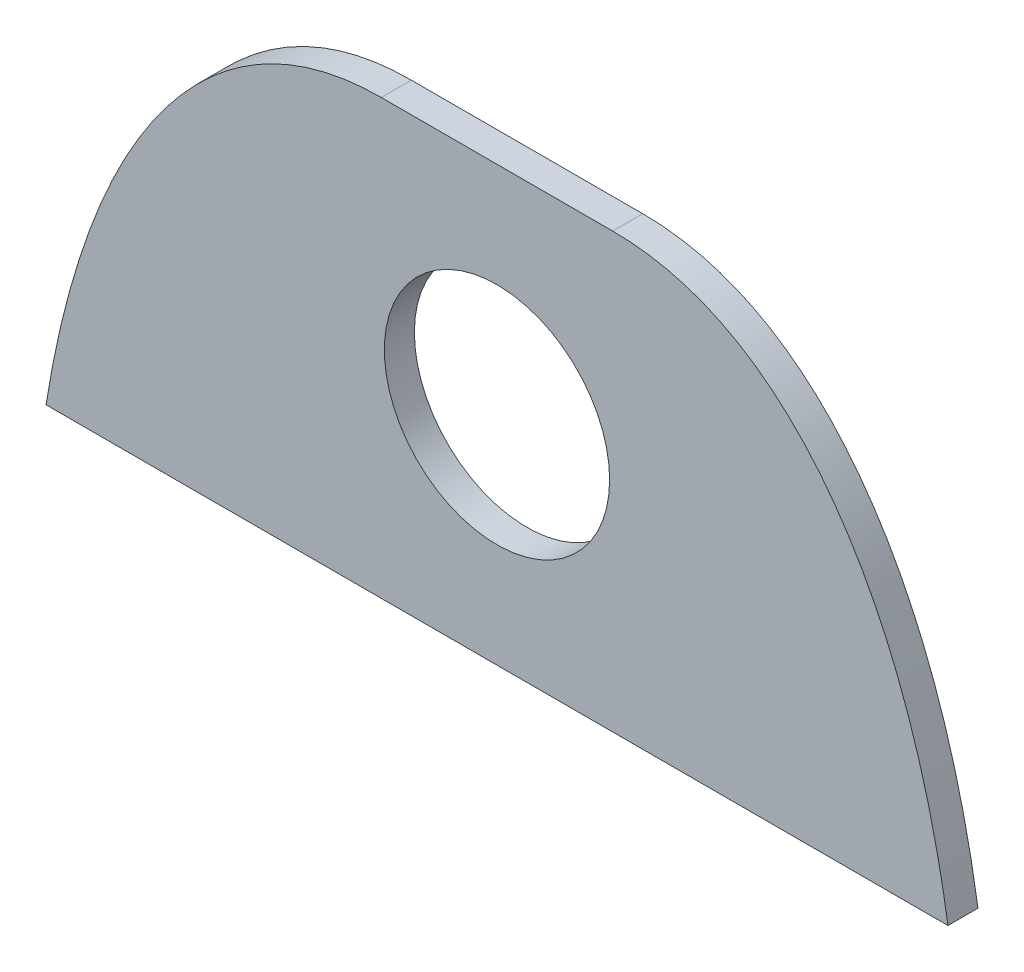
ISO-10303-21;
HEADER;
FILE_DESCRIPTION(('STEP AP214'),'2;1');
FILE_NAME('part.step','',(''),(''),'','','');
FILE_SCHEMA(('AUTOMOTIVE_DESIGN { 1 0 10303 214 1 1 1 1 }'));
ENDSEC;
DATA;
#1=APPLICATION_CONTEXT('core data for automotive mechanical design processes');
#2=APPLICATION_PROTOCOL_DEFINITION('international standard','automotive_design',2000,#1);
#3=PRODUCT_CONTEXT('',#1,'mechanical');
#4=PRODUCT('Part','Part','',(#3));
#5=PRODUCT_RELATED_PRODUCT_CATEGORY('part','',(#4));
#6=PRODUCT_DEFINITION_FORMATION('','',#4);
#7=PRODUCT_DEFINITION_CONTEXT('part definition',#1,'design');
#8=PRODUCT_DEFINITION('design','',#6,#7);
#9=PRODUCT_DEFINITION_SHAPE('','',#8);
#10=(LENGTH_UNIT() NAMED_UNIT(*) SI_UNIT(.MILLI.,.METRE.));
#11=(NAMED_UNIT(*) PLANE_ANGLE_UNIT() SI_UNIT($,.RADIAN.));
#12=(NAMED_UNIT(*) SI_UNIT($,.STERADIAN.) SOLID_ANGLE_UNIT());
#13=UNCERTAINTY_MEASURE_WITH_UNIT(LENGTH_MEASURE(1.E-05),#10,'distance_accuracy_value','');
#14=(GEOMETRIC_REPRESENTATION_CONTEXT(3) GLOBAL_UNCERTAINTY_ASSIGNED_CONTEXT((#13)) GLOBAL_UNIT_ASSIGNED_CONTEXT((#10,
#11,#12)) REPRESENTATION_CONTEXT('',''));
#15=CARTESIAN_POINT('',(0.,0.,0.));
#16=DIRECTION('',(0.,0.,1.));
#17=DIRECTION('',(1.,0.,0.));
#18=AXIS2_PLACEMENT_3D('',#15,#16,#17);
#19=CARTESIAN_POINT('',(5.66946098612702,7.33530402938872,0.508));
#20=CARTESIAN_POINT('',(5.24399608609414,7.33530402938872,0.508));
#21=CARTESIAN_POINT('',(4.82870261388946,7.27466993287705,0.508));
#22=CARTESIAN_POINT('',(4.22236554574973,7.08474385358666,0.508));
#23=CARTESIAN_POINT('',(4.02461723723038,7.00508067398969,0.508));
#24=CARTESIAN_POINT('',(3.64748565891863,6.81918342127818,0.508));
#25=CARTESIAN_POINT('',(3.46649138673624,6.71248359802857,0.508));
#26=CARTESIAN_POINT('',(3.11843433597096,6.47378192656136,0.508));
#27=CARTESIAN_POINT('',(2.95096324808215,6.34117499174921,0.508));
#28=CARTESIAN_POINT('',(2.63715643816514,6.06047445688974,0.508));
#29=CARTESIAN_POINT('',(2.48955789656992,5.91162915855113,0.508));
#30=CARTESIAN_POINT('',(2.07054123556324,5.44338386014078,0.508));
#31=CARTESIAN_POINT('',(1.82099770892891,5.09952827246685,0.508));
#32=CARTESIAN_POINT('',(1.15988363679891,4.02348098614177,0.508));
#33=CARTESIAN_POINT('',(0.833207908036054,3.25461560426947,0.508));
#34=CARTESIAN_POINT('',(0.445697358196499,2.05503805428413,0.508));
#35=CARTESIAN_POINT('',(0.334748925713697,1.64770618611744,0.508));
#36=CARTESIAN_POINT('',(0.144996604274143,0.828712341510663,0.508));
#37=CARTESIAN_POINT('',(0.0658201697768552,0.415806296298574,0.508));
#38=CARTESIAN_POINT('',(0.,0.,0.508));
#39=B_SPLINE_CURVE_WITH_KNOTS('',3,(#19,#20,#21,#22,#23,#24,#25,#26,#27,#28,#29,#30,#31,#32,#33,
#34,#35,#36,#37,#38),.UNSPECIFIED.,.F.,.F.,(4,2,2,2,2,2,2,2,2,4),(0.,0.125000000000001,
0.187500000000001,0.25,0.3125,0.375,0.499999999999999,0.749999999999999,0.875,1.),.UNSPECIFIED.);
#40=DIRECTION('',(0.,0.,-1.));
#41=VECTOR('',#40,1.);
#42=SURFACE_OF_LINEAR_EXTRUSION('',#39,#41);
#43=CARTESIAN_POINT('',(5.66946098612702,7.33530402938872,0.));
#44=CARTESIAN_POINT('',(5.24399608609414,7.33530402938872,0.));
#45=CARTESIAN_POINT('',(4.82870261388946,7.27466993287705,0.));
#46=CARTESIAN_POINT('',(4.22236554574973,7.08474385358666,0.));
#47=CARTESIAN_POINT('',(4.02461723723038,7.00508067398969,0.));
#48=CARTESIAN_POINT('',(3.64748565891863,6.81918342127818,0.));
#49=CARTESIAN_POINT('',(3.46649138673624,6.71248359802857,0.));
#50=CARTESIAN_POINT('',(3.11843433597096,6.47378192656136,0.));
#51=CARTESIAN_POINT('',(2.95096324808215,6.34117499174921,0.));
#52=CARTESIAN_POINT('',(2.63715643816514,6.06047445688974,0.));
#53=CARTESIAN_POINT('',(2.48955789656992,5.91162915855113,0.));
#54=CARTESIAN_POINT('',(2.07054123556324,5.44338386014078,0.));
#55=CARTESIAN_POINT('',(1.82099770892891,5.09952827246685,0.));
#56=CARTESIAN_POINT('',(1.15988363679891,4.02348098614177,0.));
#57=CARTESIAN_POINT('',(0.833207908036054,3.25461560426947,0.));
#58=CARTESIAN_POINT('',(0.445697358196499,2.05503805428413,0.));
#59=CARTESIAN_POINT('',(0.334748925713697,1.64770618611744,0.));
#60=CARTESIAN_POINT('',(0.144996604274143,0.828712341510663,0.));
#61=CARTESIAN_POINT('',(0.0658201697768552,0.415806296298574,0.));
#62=CARTESIAN_POINT('',(0.,0.,0.));
#63=B_SPLINE_CURVE_WITH_KNOTS('',3,(#43,#44,#45,#46,#47,#48,#49,#50,#51,#52,#53,#54,#55,#56,#57,
#58,#59,#60,#61,#62),.UNSPECIFIED.,.F.,.F.,(4,2,2,2,2,2,2,2,2,4),(0.,0.125000000000001,
0.187500000000001,0.25,0.3125,0.375,0.499999999999999,0.749999999999999,0.875,1.),.UNSPECIFIED.);
#64=CARTESIAN_POINT('',(5.66946098612702,7.33530402938872,0.));
#65=VERTEX_POINT('',#64);
#66=CARTESIAN_POINT('',(0.,0.,0.));
#67=VERTEX_POINT('',#66);
#68=EDGE_CURVE('E136',#65,#67,#63,.T.);
#69=ORIENTED_EDGE('',*,*,#68,.T.);
#70=DIRECTION('',(0.,0.,-1.));
#71=VECTOR('',#70,1.);
#72=CARTESIAN_POINT('',(0.,0.,0.508));
#73=LINE('',#72,#71);
#74=CARTESIAN_POINT('',(0.,0.,0.508));
#75=VERTEX_POINT('',#74);
#76=EDGE_CURVE('E11',#75,#67,#73,.T.);
#77=ORIENTED_EDGE('',*,*,#76,.F.);
#78=CARTESIAN_POINT('',(0.,0.,0.508));
#79=CARTESIAN_POINT('',(0.0658201697768552,0.415806296298574,0.508));
#80=CARTESIAN_POINT('',(0.144996604274143,0.828712341510663,0.508));
#81=CARTESIAN_POINT('',(0.334748925713697,1.64770618611744,0.508));
#82=CARTESIAN_POINT('',(0.445697358196499,2.05503805428413,0.508));
#83=CARTESIAN_POINT('',(0.833207908036054,3.25461560426947,0.508));
#84=CARTESIAN_POINT('',(1.15988363679891,4.02348098614177,0.508));
#85=CARTESIAN_POINT('',(1.82099770892891,5.09952827246685,0.508));
#86=CARTESIAN_POINT('',(2.07054123556324,5.44338386014078,0.508));
#87=CARTESIAN_POINT('',(2.48955789656992,5.91162915855113,0.508));
#88=CARTESIAN_POINT('',(2.63715643816514,6.06047445688974,0.508));
#89=CARTESIAN_POINT('',(2.95096324808215,6.34117499174921,0.508));
#90=CARTESIAN_POINT('',(3.11843433597096,6.47378192656136,0.508));
#91=CARTESIAN_POINT('',(3.46649138673624,6.71248359802857,0.508));
#92=CARTESIAN_POINT('',(3.64748565891863,6.81918342127818,0.508));
#93=CARTESIAN_POINT('',(4.02461723723038,7.00508067398969,0.508));
#94=CARTESIAN_POINT('',(4.22236554574973,7.08474385358666,0.508));
#95=CARTESIAN_POINT('',(4.82870261388946,7.27466993287705,0.508));
#96=CARTESIAN_POINT('',(5.24399608609414,7.33530402938872,0.508));
#97=CARTESIAN_POINT('',(5.66946098612702,7.33530402938872,0.508));
#98=B_SPLINE_CURVE_WITH_KNOTS('',3,(#78,#79,#80,#81,#82,#83,#84,#85,#86,#87,#88,#89,#90,#91,#92,
#93,#94,#95,#96,#97),.UNSPECIFIED.,.F.,.F.,(4,2,2,2,2,2,2,2,2,4),(0.,0.125,0.250000000000001,
0.500000000000001,0.625,0.6875,0.75,0.812499999999999,0.874999999999999,1.),.UNSPECIFIED.);
#99=CARTESIAN_POINT('',(5.66946098612702,7.33530402938872,0.508));
#100=VERTEX_POINT('',#99);
#101=EDGE_CURVE('E87',#100,#75,#98,.F.);
#102=ORIENTED_EDGE('',*,*,#101,.F.);
#103=DIRECTION('',(0.,0.,-1.));
#104=VECTOR('',#103,1.);
#105=CARTESIAN_POINT('',(5.66946098612702,7.33530402938872,0.508));
#106=LINE('',#105,#104);
#107=EDGE_CURVE('E196',#100,#65,#106,.T.);
#108=ORIENTED_EDGE('',*,*,#107,.T.);
#109=EDGE_LOOP('',(#69,#77,#102,#108));
#110=FACE_BOUND('',#109,.T.);
#111=ADVANCED_FACE('F30',(#110),#42,.F.);
#112=CARTESIAN_POINT('',(0.,0.,0.508));
#113=DIRECTION('',(0.,1.,0.));
#114=DIRECTION('',(0.,0.,1.));
#115=AXIS2_PLACEMENT_3D('',#112,#113,#114);
#116=PLANE('',#115);
#117=DIRECTION('',(1.,0.,0.));
#118=VECTOR('',#117,1.);
#119=CARTESIAN_POINT('',(0.,0.,0.));
#120=LINE('',#119,#118);
#121=CARTESIAN_POINT('',(15.2521996818164,0.,0.));
#122=VERTEX_POINT('',#121);
#123=EDGE_CURVE('E92',#67,#122,#120,.T.);
#124=ORIENTED_EDGE('',*,*,#123,.T.);
#125=DIRECTION('',(0.,0.,-1.));
#126=VECTOR('',#125,1.);
#127=CARTESIAN_POINT('',(15.2521996818164,0.,0.508));
#128=LINE('',#127,#126);
#129=CARTESIAN_POINT('',(15.2521996818164,0.,0.508));
#130=VERTEX_POINT('',#129);
#131=EDGE_CURVE('E41',#130,#122,#128,.T.);
#132=ORIENTED_EDGE('',*,*,#131,.F.);
#133=DIRECTION('',(1.,0.,0.));
#134=VECTOR('',#133,1.);
#135=CARTESIAN_POINT('',(0.,0.,0.508));
#136=LINE('',#135,#134);
#137=EDGE_CURVE('E81',#75,#130,#136,.T.);
#138=ORIENTED_EDGE('',*,*,#137,.F.);
#139=ORIENTED_EDGE('',*,*,#76,.T.);
#140=EDGE_LOOP('',(#124,#132,#138,#139));
#141=FACE_BOUND('',#140,.T.);
#142=ADVANCED_FACE('F91',(#141),#116,.F.);
#143=CARTESIAN_POINT('',(15.2521996818164,0.,0.508));
#144=CARTESIAN_POINT('',(15.1207046971776,0.830694340807583,0.508));
#145=CARTESIAN_POINT('',(14.9374978464808,1.64694484502402,0.508));
#146=CARTESIAN_POINT('',(14.5531063460122,2.84071305573713,0.508));
#147=CARTESIAN_POINT('',(14.4065113355869,3.23347840054969,0.508));
#148=CARTESIAN_POINT('',(14.0653978287484,4.00562340032727,0.508));
#149=CARTESIAN_POINT('',(13.8724360191829,4.38122054781542,0.508));
#150=CARTESIAN_POINT('',(13.4322374370997,5.09798558954534,0.508));
#151=CARTESIAN_POINT('',(13.1819829390798,5.44302710468932,0.508));
#152=CARTESIAN_POINT('',(12.6225692419024,6.06815241853398,0.508));
#153=CARTESIAN_POINT('',(12.3136272308752,6.34968751628862,0.508));
#154=CARTESIAN_POINT('',(11.7910410416017,6.7091891053938,0.508));
#155=CARTESIAN_POINT('',(11.6074269086612,6.81766862937541,0.508));
#156=CARTESIAN_POINT('',(11.230562195319,7.00378676662493,0.508));
#157=CARTESIAN_POINT('',(11.0359754824785,7.08240154661814,0.508));
#158=CARTESIAN_POINT('',(10.6338317079852,7.20918966695784,0.508));
#159=CARTESIAN_POINT('',(10.4251743864047,7.2573120185264,0.508));
#160=CARTESIAN_POINT('',(10.0066795562789,7.32008262209734,0.508));
#161=CARTESIAN_POINT('',(9.79558081524825,7.33530402939743,0.508));
#162=CARTESIAN_POINT('',(9.58273869568794,7.33530402939743,0.508));
#163=B_SPLINE_CURVE_WITH_KNOTS('',3,(#143,#144,#145,#146,#147,#148,#149,#150,#151,#152,#153,
#154,#155,#156,#157,#158,#159,#160,#161,#162),.UNSPECIFIED.,.F.,.F.,(4,2,2,2,2,2,2,2,2,4),(0.,
0.250000000000003,0.375000000000002,0.500000000000002,0.625000000000001,0.75,0.8125,0.875,
0.9375,1.),.UNSPECIFIED.);
#164=DIRECTION('',(0.,0.,-1.));
#165=VECTOR('',#164,1.);
#166=SURFACE_OF_LINEAR_EXTRUSION('',#163,#165);
#167=CARTESIAN_POINT('',(15.2521996818164,0.,0.));
#168=CARTESIAN_POINT('',(15.1207046971776,0.830694340807583,0.));
#169=CARTESIAN_POINT('',(14.9374978464808,1.64694484502402,0.));
#170=CARTESIAN_POINT('',(14.5531063460122,2.84071305573713,0.));
#171=CARTESIAN_POINT('',(14.4065113355869,3.23347840054969,0.));
#172=CARTESIAN_POINT('',(14.0653978287484,4.00562340032727,0.));
#173=CARTESIAN_POINT('',(13.8724360191829,4.38122054781542,0.));
#174=CARTESIAN_POINT('',(13.4322374370997,5.09798558954534,0.));
#175=CARTESIAN_POINT('',(13.1819829390798,5.44302710468932,0.));
#176=CARTESIAN_POINT('',(12.6225692419024,6.06815241853398,0.));
#177=CARTESIAN_POINT('',(12.3136272308752,6.34968751628862,0.));
#178=CARTESIAN_POINT('',(11.7910410416017,6.7091891053938,0.));
#179=CARTESIAN_POINT('',(11.6074269086612,6.81766862937541,0.));
#180=CARTESIAN_POINT('',(11.230562195319,7.00378676662493,0.));
#181=CARTESIAN_POINT('',(11.0359754824785,7.08240154661814,0.));
#182=CARTESIAN_POINT('',(10.6338317079852,7.20918966695784,0.));
#183=CARTESIAN_POINT('',(10.4251743864047,7.2573120185264,0.));
#184=CARTESIAN_POINT('',(10.0066795562789,7.32008262209734,0.));
#185=CARTESIAN_POINT('',(9.79558081524825,7.33530402939743,0.));
#186=CARTESIAN_POINT('',(9.58273869568794,7.33530402939743,0.));
#187=B_SPLINE_CURVE_WITH_KNOTS('',3,(#167,#168,#169,#170,#171,#172,#173,#174,#175,#176,#177,
#178,#179,#180,#181,#182,#183,#184,#185,#186),.UNSPECIFIED.,.F.,.F.,(4,2,2,2,2,2,2,2,2,4),(0.,
0.250000000000003,0.375000000000002,0.500000000000002,0.625000000000001,0.75,0.8125,0.875,
0.9375,1.),.UNSPECIFIED.);
#188=CARTESIAN_POINT('',(9.58273869568794,7.33530402939743,0.));
#189=VERTEX_POINT('',#188);
#190=EDGE_CURVE('E67',#122,#189,#187,.T.);
#191=ORIENTED_EDGE('',*,*,#190,.T.);
#192=DIRECTION('',(0.,0.,-1.));
#193=VECTOR('',#192,1.);
#194=CARTESIAN_POINT('',(9.58273869568794,7.33530402939743,0.508));
#195=LINE('',#194,#193);
#196=CARTESIAN_POINT('',(9.58273869568794,7.33530402939743,0.508));
#197=VERTEX_POINT('',#196);
#198=EDGE_CURVE('E93',#197,#189,#195,.T.);
#199=ORIENTED_EDGE('',*,*,#198,.F.);
#200=CARTESIAN_POINT('',(9.58273869568794,7.33530402939743,0.508));
#201=CARTESIAN_POINT('',(9.79558081524825,7.33530402939743,0.508));
#202=CARTESIAN_POINT('',(10.0066795562789,7.32008262209734,0.508));
#203=CARTESIAN_POINT('',(10.4251743864047,7.2573120185264,0.508));
#204=CARTESIAN_POINT('',(10.6338317079852,7.20918966695784,0.508));
#205=CARTESIAN_POINT('',(11.0359754824785,7.08240154661814,0.508));
#206=CARTESIAN_POINT('',(11.230562195319,7.00378676662493,0.508));
#207=CARTESIAN_POINT('',(11.6074269086612,6.81766862937541,0.508));
#208=CARTESIAN_POINT('',(11.7910410416017,6.7091891053938,0.508));
#209=CARTESIAN_POINT('',(12.3136272308752,6.34968751628862,0.508));
#210=CARTESIAN_POINT('',(12.6225692419024,6.06815241853398,0.508));
#211=CARTESIAN_POINT('',(13.1819829390798,5.44302710468932,0.508));
#212=CARTESIAN_POINT('',(13.4322374370997,5.09798558954534,0.508));
#213=CARTESIAN_POINT('',(13.8724360191829,4.38122054781542,0.508));
#214=CARTESIAN_POINT('',(14.0653978287484,4.00562340032727,0.508));
#215=CARTESIAN_POINT('',(14.4065113355869,3.23347840054969,0.508));
#216=CARTESIAN_POINT('',(14.5531063460122,2.84071305573713,0.508));
#217=CARTESIAN_POINT('',(14.9374978464808,1.64694484502402,0.508));
#218=CARTESIAN_POINT('',(15.1207046971776,0.830694340807583,0.508));
#219=CARTESIAN_POINT('',(15.2521996818164,0.,0.508));
#220=B_SPLINE_CURVE_WITH_KNOTS('',3,(#200,#201,#202,#203,#204,#205,#206,#207,#208,#209,#210,
#211,#212,#213,#214,#215,#216,#217,#218,#219),.UNSPECIFIED.,.F.,.F.,(4,2,2,2,2,2,2,2,2,4),(0.,
0.0624999999999999,0.125,0.1875,0.25,0.374999999999999,0.499999999999998,0.624999999999998,
0.749999999999997,1.),.UNSPECIFIED.);
#221=EDGE_CURVE('E84',#130,#197,#220,.F.);
#222=ORIENTED_EDGE('',*,*,#221,.F.);
#223=ORIENTED_EDGE('',*,*,#131,.T.);
#224=EDGE_LOOP('',(#191,#199,#222,#223));
#225=FACE_BOUND('',#224,.T.);
#226=ADVANCED_FACE('F96',(#225),#166,.F.);
#227=CARTESIAN_POINT('',(9.58273869568794,7.33530402939743,0.508));
#228=DIRECTION('',(2.22554591253856E-12,-1.,0.));
#229=DIRECTION('',(1.,2.22554591253856E-12,0.));
#230=AXIS2_PLACEMENT_3D('',#227,#228,#229);
#231=PLANE('',#230);
#232=DIRECTION('',(-1.,-2.22554591253856E-12,0.));
#233=VECTOR('',#232,1.);
#234=CARTESIAN_POINT('',(9.58273869568794,7.33530402939743,0.));
#235=LINE('',#234,#233);
#236=EDGE_CURVE('E74',#189,#65,#235,.T.);
#237=ORIENTED_EDGE('',*,*,#236,.T.);
#238=ORIENTED_EDGE('',*,*,#107,.F.);
#239=DIRECTION('',(-1.,-2.22554591253856E-12,0.));
#240=VECTOR('',#239,1.);
#241=CARTESIAN_POINT('',(9.58273869568794,7.33530402939743,0.508));
#242=LINE('',#241,#240);
#243=EDGE_CURVE('E50',#197,#100,#242,.T.);
#244=ORIENTED_EDGE('',*,*,#243,.F.);
#245=ORIENTED_EDGE('',*,*,#198,.T.);
#246=EDGE_LOOP('',(#237,#238,#244,#245));
#247=FACE_BOUND('',#246,.T.);
#248=ADVANCED_FACE('F115',(#247),#231,.F.);
#249=CARTESIAN_POINT('',(1.60062635155223,4.74084584369182,0.508));
#250=DIRECTION('',(0.,0.,-1.));
#251=DIRECTION('',(-1.,0.,0.));
#252=AXIS2_PLACEMENT_3D('',#249,#250,#251);
#253=PLANE('',#252);
#254=CARTESIAN_POINT('',(7.62609984090748,3.66765201469436,0.508));
#255=DIRECTION('',(0.,0.,1.));
#256=DIRECTION('',(1.,0.,0.));
#257=AXIS2_PLACEMENT_3D('',#254,#255,#256);
#258=CIRCLE('',#257,1.905);
#259=CARTESIAN_POINT('',(9.53109984090748,3.66765201469436,0.508));
#260=VERTEX_POINT('',#259);
#261=EDGE_CURVE('E128',#260,#260,#258,.T.);
#262=ORIENTED_EDGE('',*,*,#261,.F.);
#263=EDGE_LOOP('',(#262));
#264=FACE_BOUND('',#263,.T.);
#265=ORIENTED_EDGE('',*,*,#101,.T.);
#266=ORIENTED_EDGE('',*,*,#137,.T.);
#267=ORIENTED_EDGE('',*,*,#221,.T.);
#268=ORIENTED_EDGE('',*,*,#243,.T.);
#269=EDGE_LOOP('',(#265,#266,#267,#268));
#270=FACE_BOUND('',#269,.T.);
#271=ADVANCED_FACE('F82',(#264,#270),#253,.F.);
#272=CARTESIAN_POINT('',(1.60062635155223,4.74084584369182,0.));
#273=DIRECTION('',(0.,0.,-1.));
#274=DIRECTION('',(-1.,0.,0.));
#275=AXIS2_PLACEMENT_3D('',#272,#273,#274);
#276=PLANE('',#275);
#277=CARTESIAN_POINT('',(7.62609984090748,3.66765201469436,0.));
#278=DIRECTION('',(0.,0.,-1.));
#279=DIRECTION('',(-1.,0.,0.));
#280=AXIS2_PLACEMENT_3D('',#277,#278,#279);
#281=CIRCLE('',#280,1.905);
#282=CARTESIAN_POINT('',(5.72109984090748,3.66765201469436,0.));
#283=VERTEX_POINT('',#282);
#284=EDGE_CURVE('E35',#283,#283,#281,.T.);
#285=ORIENTED_EDGE('',*,*,#284,.F.);
#286=EDGE_LOOP('',(#285));
#287=FACE_BOUND('',#286,.T.);
#288=ORIENTED_EDGE('',*,*,#68,.F.);
#289=ORIENTED_EDGE('',*,*,#236,.F.);
#290=ORIENTED_EDGE('',*,*,#190,.F.);
#291=ORIENTED_EDGE('',*,*,#123,.F.);
#292=EDGE_LOOP('',(#288,#289,#290,#291));
#293=FACE_BOUND('',#292,.T.);
#294=ADVANCED_FACE('F166',(#287,#293),#276,.T.);
#295=CARTESIAN_POINT('',(7.62609984090748,3.66765201469436,-0.01));
#296=DIRECTION('',(0.,0.,1.));
#297=DIRECTION('',(1.,0.,0.));
#298=AXIS2_PLACEMENT_3D('',#295,#296,#297);
#299=CYLINDRICAL_SURFACE('',#298,1.905);
#300=ORIENTED_EDGE('',*,*,#284,.T.);
#301=EDGE_LOOP('',(#300));
#302=FACE_BOUND('',#301,.T.);
#303=ORIENTED_EDGE('',*,*,#261,.T.);
#304=EDGE_LOOP('',(#303));
#305=FACE_BOUND('',#304,.T.);
#306=ADVANCED_FACE('F168',(#302,#305),#299,.F.);
#307=CLOSED_SHELL('',(#111,#142,#226,#248,#271,#294,#306));
#308=MANIFOLD_SOLID_BREP('B2',#307);
#309=ADVANCED_BREP_SHAPE_REPRESENTATION('',(#18,#308),#14);
#310=SHAPE_DEFINITION_REPRESENTATION(#9,#309);
ENDSEC;
END-ISO-10303-21;
